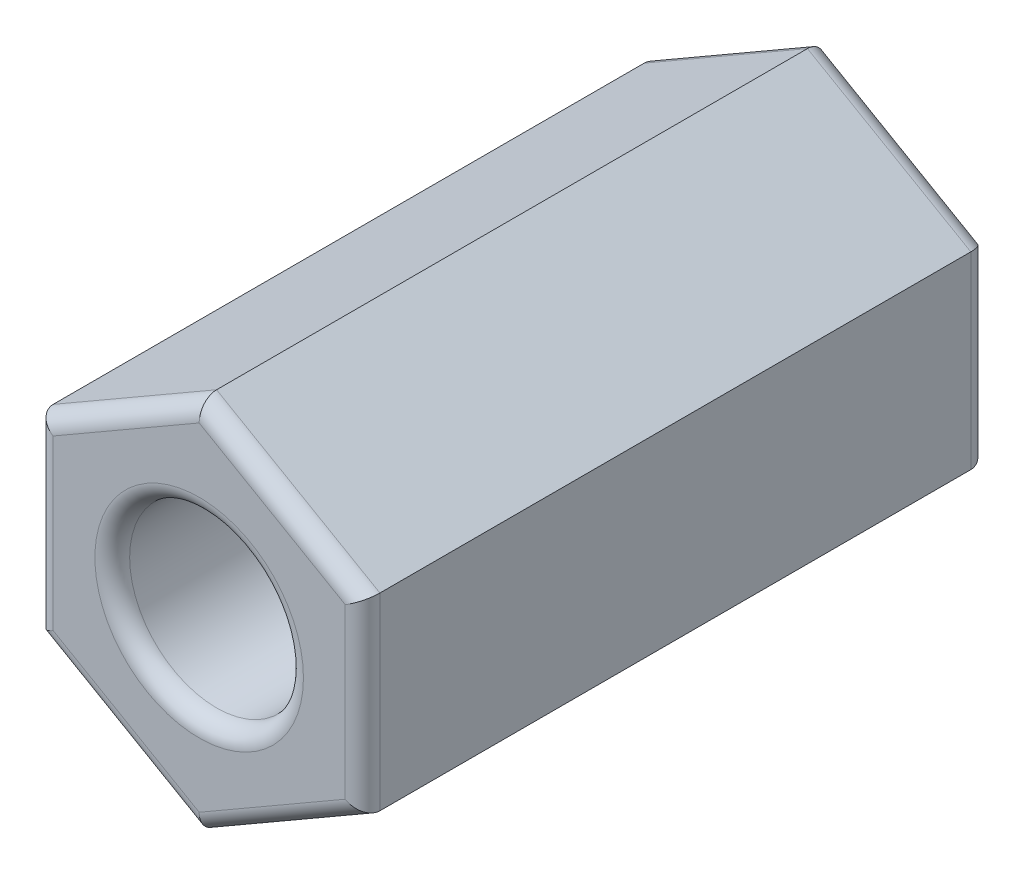
ISO-10303-21;
HEADER;
FILE_DESCRIPTION(('STEP AP214'),'2;1');
FILE_NAME('part.step','',(''),(''),'','','');
FILE_SCHEMA(('AUTOMOTIVE_DESIGN { 1 0 10303 214 1 1 1 1 }'));
ENDSEC;
DATA;
#1=APPLICATION_CONTEXT('core data for automotive mechanical design processes');
#2=APPLICATION_PROTOCOL_DEFINITION('international standard','automotive_design',2000,#1);
#3=PRODUCT_CONTEXT('',#1,'mechanical');
#4=PRODUCT('Part','Part','',(#3));
#5=PRODUCT_RELATED_PRODUCT_CATEGORY('part','',(#4));
#6=PRODUCT_DEFINITION_FORMATION('','',#4);
#7=PRODUCT_DEFINITION_CONTEXT('part definition',#1,'design');
#8=PRODUCT_DEFINITION('design','',#6,#7);
#9=PRODUCT_DEFINITION_SHAPE('','',#8);
#10=(LENGTH_UNIT() NAMED_UNIT(*) SI_UNIT(.MILLI.,.METRE.));
#11=(NAMED_UNIT(*) PLANE_ANGLE_UNIT() SI_UNIT($,.RADIAN.));
#12=(NAMED_UNIT(*) SI_UNIT($,.STERADIAN.) SOLID_ANGLE_UNIT());
#13=UNCERTAINTY_MEASURE_WITH_UNIT(LENGTH_MEASURE(1.E-05),#10,'distance_accuracy_value','');
#14=(GEOMETRIC_REPRESENTATION_CONTEXT(3) GLOBAL_UNCERTAINTY_ASSIGNED_CONTEXT((#13)) GLOBAL_UNIT_ASSIGNED_CONTEXT((#10,
#11,#12)) REPRESENTATION_CONTEXT('',''));
#15=CARTESIAN_POINT('',(0.,0.,0.));
#16=DIRECTION('',(0.,0.,1.));
#17=DIRECTION('',(1.,0.,0.));
#18=AXIS2_PLACEMENT_3D('',#15,#16,#17);
#19=CARTESIAN_POINT('',(0.,0.,9.));
#20=DIRECTION('',(0.,0.,1.));
#21=DIRECTION('',(1.,0.,0.));
#22=AXIS2_PLACEMENT_3D('',#19,#20,#21);
#23=PLANE('',#22);
#24=CARTESIAN_POINT('',(0.,0.,9.));
#25=DIRECTION('',(0.,0.,1.));
#26=DIRECTION('',(1.,0.,0.));
#27=AXIS2_PLACEMENT_3D('',#24,#25,#26);
#28=CIRCLE('',#27,1.5);
#29=CARTESIAN_POINT('',(1.5,0.,9.));
#30=VERTEX_POINT('',#29);
#31=EDGE_CURVE('E11',#30,#30,#28,.F.);
#32=ORIENTED_EDGE('',*,*,#31,.T.);
#33=EDGE_LOOP('',(#32));
#34=FACE_BOUND('',#33,.T.);
#35=DIRECTION('',(-0.866025403784439,-0.5,0.));
#36=VECTOR('',#35,1.);
#37=CARTESIAN_POINT('',(-2.225,1.14026678164951,9.));
#38=LINE('',#37,#36);
#39=CARTESIAN_POINT('',(0.,2.42487113059643,9.));
#40=VERTEX_POINT('',#39);
#41=CARTESIAN_POINT('',(-2.1,1.21243556529821,9.));
#42=VERTEX_POINT('',#41);
#43=EDGE_CURVE('E262',#40,#42,#38,.T.);
#44=ORIENTED_EDGE('',*,*,#43,.T.);
#45=DIRECTION('',(0.,-1.,0.));
#46=VECTOR('',#45,1.);
#47=CARTESIAN_POINT('',(-2.1,-1.35677313259562,9.));
#48=LINE('',#47,#46);
#49=CARTESIAN_POINT('',(-2.1,-1.21243556529821,9.));
#50=VERTEX_POINT('',#49);
#51=EDGE_CURVE('E137',#42,#50,#48,.T.);
#52=ORIENTED_EDGE('',*,*,#51,.T.);
#53=DIRECTION('',(0.866025403784439,-0.5,0.));
#54=VECTOR('',#53,1.);
#55=CARTESIAN_POINT('',(0.124999999999999,-2.49703991424513,9.));
#56=LINE('',#55,#54);
#57=CARTESIAN_POINT('',(0.,-2.42487113059643,9.));
#58=VERTEX_POINT('',#57);
#59=EDGE_CURVE('E160',#50,#58,#56,.T.);
#60=ORIENTED_EDGE('',*,*,#59,.T.);
#61=DIRECTION('',(0.866025403784439,0.5,0.));
#62=VECTOR('',#61,1.);
#63=CARTESIAN_POINT('',(2.225,-1.14026678164951,9.));
#64=LINE('',#63,#62);
#65=CARTESIAN_POINT('',(2.1,-1.21243556529821,9.));
#66=VERTEX_POINT('',#65);
#67=EDGE_CURVE('E266',#58,#66,#64,.T.);
#68=ORIENTED_EDGE('',*,*,#67,.T.);
#69=DIRECTION('',(0.,1.,0.));
#70=VECTOR('',#69,1.);
#71=CARTESIAN_POINT('',(2.1,1.35677313259562,9.));
#72=LINE('',#71,#70);
#73=CARTESIAN_POINT('',(2.1,1.21243556529821,9.));
#74=VERTEX_POINT('',#73);
#75=EDGE_CURVE('E264',#66,#74,#72,.T.);
#76=ORIENTED_EDGE('',*,*,#75,.T.);
#77=DIRECTION('',(-0.866025403784439,0.5,0.));
#78=VECTOR('',#77,1.);
#79=CARTESIAN_POINT('',(-0.125000000000001,2.49703991424513,9.));
#80=LINE('',#79,#78);
#81=EDGE_CURVE('E220',#74,#40,#80,.T.);
#82=ORIENTED_EDGE('',*,*,#81,.T.);
#83=EDGE_LOOP('',(#44,#52,#60,#68,#76,#82));
#84=FACE_BOUND('',#83,.T.);
#85=ADVANCED_FACE('F34',(#34,#84),#23,.T.);
#86=CARTESIAN_POINT('',(0.,0.,0.));
#87=DIRECTION('',(0.,0.,1.));
#88=DIRECTION('',(1.,0.,0.));
#89=AXIS2_PLACEMENT_3D('',#86,#87,#88);
#90=PLANE('',#89);
#91=CARTESIAN_POINT('',(0.,0.,0.));
#92=DIRECTION('',(0.,0.,1.));
#93=DIRECTION('',(1.,0.,0.));
#94=AXIS2_PLACEMENT_3D('',#91,#92,#93);
#95=CIRCLE('',#94,1.5);
#96=CARTESIAN_POINT('',(1.5,0.,0.));
#97=VERTEX_POINT('',#96);
#98=EDGE_CURVE('E180',#97,#97,#95,.T.);
#99=ORIENTED_EDGE('',*,*,#98,.T.);
#100=EDGE_LOOP('',(#99));
#101=FACE_BOUND('',#100,.T.);
#102=DIRECTION('',(0.866025403784439,-0.5,0.));
#103=VECTOR('',#102,1.);
#104=CARTESIAN_POINT('',(-1.05,-1.81865334794732,0.));
#105=LINE('',#104,#103);
#106=CARTESIAN_POINT('',(0.,-2.42487113059643,0.));
#107=VERTEX_POINT('',#106);
#108=CARTESIAN_POINT('',(-2.1,-1.21243556529821,0.));
#109=VERTEX_POINT('',#108);
#110=EDGE_CURVE('E204',#107,#109,#105,.F.);
#111=ORIENTED_EDGE('',*,*,#110,.T.);
#112=DIRECTION('',(0.,-1.,0.));
#113=VECTOR('',#112,1.);
#114=CARTESIAN_POINT('',(-2.1,0.,0.));
#115=LINE('',#114,#113);
#116=CARTESIAN_POINT('',(-2.1,1.21243556529821,0.));
#117=VERTEX_POINT('',#116);
#118=EDGE_CURVE('E206',#109,#117,#115,.F.);
#119=ORIENTED_EDGE('',*,*,#118,.T.);
#120=DIRECTION('',(-0.866025403784439,-0.5,0.));
#121=VECTOR('',#120,1.);
#122=CARTESIAN_POINT('',(-1.05,1.81865334794732,0.));
#123=LINE('',#122,#121);
#124=CARTESIAN_POINT('',(0.,2.42487113059643,0.));
#125=VERTEX_POINT('',#124);
#126=EDGE_CURVE('E256',#117,#125,#123,.F.);
#127=ORIENTED_EDGE('',*,*,#126,.T.);
#128=DIRECTION('',(-0.866025403784439,0.5,0.));
#129=VECTOR('',#128,1.);
#130=CARTESIAN_POINT('',(1.05,1.81865334794732,0.));
#131=LINE('',#130,#129);
#132=CARTESIAN_POINT('',(2.1,1.21243556529821,0.));
#133=VERTEX_POINT('',#132);
#134=EDGE_CURVE('E254',#125,#133,#131,.F.);
#135=ORIENTED_EDGE('',*,*,#134,.T.);
#136=DIRECTION('',(0.,1.,0.));
#137=VECTOR('',#136,1.);
#138=CARTESIAN_POINT('',(2.1,0.,0.));
#139=LINE('',#138,#137);
#140=CARTESIAN_POINT('',(2.1,-1.21243556529821,0.));
#141=VERTEX_POINT('',#140);
#142=EDGE_CURVE('E258',#133,#141,#139,.F.);
#143=ORIENTED_EDGE('',*,*,#142,.T.);
#144=DIRECTION('',(0.866025403784439,0.5,0.));
#145=VECTOR('',#144,1.);
#146=CARTESIAN_POINT('',(1.05,-1.81865334794732,0.));
#147=LINE('',#146,#145);
#148=EDGE_CURVE('E208',#141,#107,#147,.F.);
#149=ORIENTED_EDGE('',*,*,#148,.T.);
#150=EDGE_LOOP('',(#111,#119,#127,#135,#143,#149));
#151=FACE_BOUND('',#150,.T.);
#152=ADVANCED_FACE('F197',(#101,#151),#90,.F.);
#153=CARTESIAN_POINT('',(2.35,-1.35677313259562,9.));
#154=DIRECTION('',(-1.,0.,0.));
#155=DIRECTION('',(0.,-1.,0.));
#156=AXIS2_PLACEMENT_3D('',#153,#154,#155);
#157=PLANE('',#156);
#158=DIRECTION('',(0.,0.,-1.));
#159=VECTOR('',#158,1.);
#160=CARTESIAN_POINT('',(2.35,1.35677313259562,9.));
#161=LINE('',#160,#159);
#162=CARTESIAN_POINT('',(2.35,1.35677313259562,8.75));
#163=VERTEX_POINT('',#162);
#164=CARTESIAN_POINT('',(2.35,1.35677313259562,0.25));
#165=VERTEX_POINT('',#164);
#166=EDGE_CURVE('E157',#163,#165,#161,.T.);
#167=ORIENTED_EDGE('',*,*,#166,.F.);
#168=DIRECTION('',(0.,1.,0.));
#169=VECTOR('',#168,1.);
#170=CARTESIAN_POINT('',(2.35,-1.35677313259562,8.75));
#171=LINE('',#170,#169);
#172=CARTESIAN_POINT('',(2.35,-1.35677313259562,8.75));
#173=VERTEX_POINT('',#172);
#174=EDGE_CURVE('E277',#163,#173,#171,.F.);
#175=ORIENTED_EDGE('',*,*,#174,.T.);
#176=DIRECTION('',(0.,0.,-1.));
#177=VECTOR('',#176,1.);
#178=CARTESIAN_POINT('',(2.35,-1.35677313259562,9.));
#179=LINE('',#178,#177);
#180=CARTESIAN_POINT('',(2.35,-1.35677313259562,0.25));
#181=VERTEX_POINT('',#180);
#182=EDGE_CURVE('E238',#173,#181,#179,.T.);
#183=ORIENTED_EDGE('',*,*,#182,.T.);
#184=DIRECTION('',(0.,1.,0.));
#185=VECTOR('',#184,1.);
#186=CARTESIAN_POINT('',(2.35,-1.35677313259562,0.25));
#187=LINE('',#186,#185);
#188=EDGE_CURVE('E275',#181,#165,#187,.T.);
#189=ORIENTED_EDGE('',*,*,#188,.T.);
#190=EDGE_LOOP('',(#167,#175,#183,#189));
#191=FACE_BOUND('',#190,.T.);
#192=ADVANCED_FACE('F200',(#191),#157,.F.);
#193=CARTESIAN_POINT('',(2.35,1.35677313259562,9.));
#194=DIRECTION('',(-0.5,-0.866025403784439,0.));
#195=DIRECTION('',(0.866025403784439,-0.5,0.));
#196=AXIS2_PLACEMENT_3D('',#193,#194,#195);
#197=PLANE('',#196);
#198=DIRECTION('',(0.,0.,-1.));
#199=VECTOR('',#198,1.);
#200=CARTESIAN_POINT('',(0.,2.71354626519124,9.));
#201=LINE('',#200,#199);
#202=CARTESIAN_POINT('',(0.,2.71354626519124,8.75));
#203=VERTEX_POINT('',#202);
#204=CARTESIAN_POINT('',(0.,2.71354626519124,0.25));
#205=VERTEX_POINT('',#204);
#206=EDGE_CURVE('E250',#203,#205,#201,.T.);
#207=ORIENTED_EDGE('',*,*,#206,.F.);
#208=DIRECTION('',(-0.866025403784439,0.5,0.));
#209=VECTOR('',#208,1.);
#210=CARTESIAN_POINT('',(2.35,1.35677313259562,8.75));
#211=LINE('',#210,#209);
#212=EDGE_CURVE('E184',#203,#163,#211,.F.);
#213=ORIENTED_EDGE('',*,*,#212,.T.);
#214=ORIENTED_EDGE('',*,*,#166,.T.);
#215=DIRECTION('',(-0.866025403784439,0.5,0.));
#216=VECTOR('',#215,1.);
#217=CARTESIAN_POINT('',(2.35,1.35677313259562,0.25));
#218=LINE('',#217,#216);
#219=EDGE_CURVE('E49',#165,#205,#218,.T.);
#220=ORIENTED_EDGE('',*,*,#219,.T.);
#221=EDGE_LOOP('',(#207,#213,#214,#220));
#222=FACE_BOUND('',#221,.T.);
#223=ADVANCED_FACE('F283',(#222),#197,.F.);
#224=CARTESIAN_POINT('',(0.,2.71354626519124,9.));
#225=DIRECTION('',(0.5,-0.866025403784439,0.));
#226=DIRECTION('',(0.866025403784439,0.5,0.));
#227=AXIS2_PLACEMENT_3D('',#224,#225,#226);
#228=PLANE('',#227);
#229=ORIENTED_EDGE('',*,*,#206,.T.);
#230=DIRECTION('',(-0.866025403784439,-0.5,0.));
#231=VECTOR('',#230,1.);
#232=CARTESIAN_POINT('',(0.,2.71354626519124,0.25));
#233=LINE('',#232,#231);
#234=CARTESIAN_POINT('',(-2.35,1.35677313259562,0.25));
#235=VERTEX_POINT('',#234);
#236=EDGE_CURVE('E280',#205,#235,#233,.T.);
#237=ORIENTED_EDGE('',*,*,#236,.T.);
#238=DIRECTION('',(0.,0.,-1.));
#239=VECTOR('',#238,1.);
#240=CARTESIAN_POINT('',(-2.35,1.35677313259562,9.));
#241=LINE('',#240,#239);
#242=CARTESIAN_POINT('',(-2.35,1.35677313259562,8.75));
#243=VERTEX_POINT('',#242);
#244=EDGE_CURVE('E148',#243,#235,#241,.T.);
#245=ORIENTED_EDGE('',*,*,#244,.F.);
#246=DIRECTION('',(-0.866025403784439,-0.5,0.));
#247=VECTOR('',#246,1.);
#248=CARTESIAN_POINT('',(0.,2.71354626519124,8.75));
#249=LINE('',#248,#247);
#250=EDGE_CURVE('E56',#243,#203,#249,.F.);
#251=ORIENTED_EDGE('',*,*,#250,.T.);
#252=EDGE_LOOP('',(#229,#237,#245,#251));
#253=FACE_BOUND('',#252,.T.);
#254=ADVANCED_FACE('F328',(#253),#228,.F.);
#255=CARTESIAN_POINT('',(-2.35,1.35677313259562,9.));
#256=DIRECTION('',(1.,0.,0.));
#257=DIRECTION('',(0.,1.,0.));
#258=AXIS2_PLACEMENT_3D('',#255,#256,#257);
#259=PLANE('',#258);
#260=ORIENTED_EDGE('',*,*,#244,.T.);
#261=DIRECTION('',(0.,-1.,0.));
#262=VECTOR('',#261,1.);
#263=CARTESIAN_POINT('',(-2.35,1.35677313259562,0.25));
#264=LINE('',#263,#262);
#265=CARTESIAN_POINT('',(-2.35,-1.35677313259562,0.25));
#266=VERTEX_POINT('',#265);
#267=EDGE_CURVE('E147',#235,#266,#264,.T.);
#268=ORIENTED_EDGE('',*,*,#267,.T.);
#269=DIRECTION('',(0.,0.,-1.));
#270=VECTOR('',#269,1.);
#271=CARTESIAN_POINT('',(-2.35,-1.35677313259562,9.));
#272=LINE('',#271,#270);
#273=CARTESIAN_POINT('',(-2.35,-1.35677313259562,8.75));
#274=VERTEX_POINT('',#273);
#275=EDGE_CURVE('E129',#274,#266,#272,.T.);
#276=ORIENTED_EDGE('',*,*,#275,.F.);
#277=DIRECTION('',(0.,-1.,0.));
#278=VECTOR('',#277,1.);
#279=CARTESIAN_POINT('',(-2.35,1.35677313259562,8.75));
#280=LINE('',#279,#278);
#281=EDGE_CURVE('E145',#274,#243,#280,.F.);
#282=ORIENTED_EDGE('',*,*,#281,.T.);
#283=EDGE_LOOP('',(#260,#268,#276,#282));
#284=FACE_BOUND('',#283,.T.);
#285=ADVANCED_FACE('F144',(#284),#259,.F.);
#286=CARTESIAN_POINT('',(-2.35,-1.35677313259562,9.));
#287=DIRECTION('',(0.5,0.866025403784439,0.));
#288=DIRECTION('',(-0.866025403784439,0.5,0.));
#289=AXIS2_PLACEMENT_3D('',#286,#287,#288);
#290=PLANE('',#289);
#291=ORIENTED_EDGE('',*,*,#275,.T.);
#292=DIRECTION('',(0.866025403784439,-0.5,0.));
#293=VECTOR('',#292,1.);
#294=CARTESIAN_POINT('',(-2.35,-1.35677313259562,0.25));
#295=LINE('',#294,#293);
#296=CARTESIAN_POINT('',(0.,-2.71354626519124,0.25));
#297=VERTEX_POINT('',#296);
#298=EDGE_CURVE('E136',#266,#297,#295,.T.);
#299=ORIENTED_EDGE('',*,*,#298,.T.);
#300=DIRECTION('',(0.,0.,-1.));
#301=VECTOR('',#300,1.);
#302=CARTESIAN_POINT('',(0.,-2.71354626519124,9.));
#303=LINE('',#302,#301);
#304=CARTESIAN_POINT('',(0.,-2.71354626519124,8.75));
#305=VERTEX_POINT('',#304);
#306=EDGE_CURVE('E131',#305,#297,#303,.T.);
#307=ORIENTED_EDGE('',*,*,#306,.F.);
#308=DIRECTION('',(0.866025403784439,-0.5,0.));
#309=VECTOR('',#308,1.);
#310=CARTESIAN_POINT('',(-2.35,-1.35677313259562,8.75));
#311=LINE('',#310,#309);
#312=EDGE_CURVE('E126',#305,#274,#311,.F.);
#313=ORIENTED_EDGE('',*,*,#312,.T.);
#314=EDGE_LOOP('',(#291,#299,#307,#313));
#315=FACE_BOUND('',#314,.T.);
#316=ADVANCED_FACE('F128',(#315),#290,.F.);
#317=CARTESIAN_POINT('',(0.,-2.71354626519124,9.));
#318=DIRECTION('',(-0.5,0.866025403784439,0.));
#319=DIRECTION('',(-0.866025403784439,-0.5,0.));
#320=AXIS2_PLACEMENT_3D('',#317,#318,#319);
#321=PLANE('',#320);
#322=ORIENTED_EDGE('',*,*,#306,.T.);
#323=DIRECTION('',(0.866025403784439,0.5,0.));
#324=VECTOR('',#323,1.);
#325=CARTESIAN_POINT('',(0.,-2.71354626519124,0.25));
#326=LINE('',#325,#324);
#327=EDGE_CURVE('E273',#297,#181,#326,.T.);
#328=ORIENTED_EDGE('',*,*,#327,.T.);
#329=ORIENTED_EDGE('',*,*,#182,.F.);
#330=DIRECTION('',(0.866025403784439,0.5,0.));
#331=VECTOR('',#330,1.);
#332=CARTESIAN_POINT('',(0.,-2.71354626519124,8.75));
#333=LINE('',#332,#331);
#334=EDGE_CURVE('E271',#173,#305,#333,.F.);
#335=ORIENTED_EDGE('',*,*,#334,.T.);
#336=EDGE_LOOP('',(#322,#328,#329,#335));
#337=FACE_BOUND('',#336,.T.);
#338=ADVANCED_FACE('F301',(#337),#321,.F.);
#339=CARTESIAN_POINT('',(0.,0.,9.));
#340=DIRECTION('',(0.,0.,-1.));
#341=DIRECTION('',(-1.,0.,0.));
#342=AXIS2_PLACEMENT_3D('',#339,#340,#341);
#343=CYLINDRICAL_SURFACE('',#342,1.25);
#344=CARTESIAN_POINT('',(0.,0.,0.25));
#345=DIRECTION('',(0.,0.,1.));
#346=DIRECTION('',(1.,0.,0.));
#347=AXIS2_PLACEMENT_3D('',#344,#345,#346);
#348=CIRCLE('',#347,1.25);
#349=CARTESIAN_POINT('',(1.25,0.,0.25));
#350=VERTEX_POINT('',#349);
#351=EDGE_CURVE('E42',#350,#350,#348,.F.);
#352=ORIENTED_EDGE('',*,*,#351,.T.);
#353=EDGE_LOOP('',(#352));
#354=FACE_BOUND('',#353,.T.);
#355=CARTESIAN_POINT('',(0.,0.,8.75));
#356=DIRECTION('',(0.,0.,1.));
#357=DIRECTION('',(1.,0.,0.));
#358=AXIS2_PLACEMENT_3D('',#355,#356,#357);
#359=CIRCLE('',#358,1.25);
#360=CARTESIAN_POINT('',(1.25,0.,8.75));
#361=VERTEX_POINT('',#360);
#362=EDGE_CURVE('E183',#361,#361,#359,.T.);
#363=ORIENTED_EDGE('',*,*,#362,.T.);
#364=EDGE_LOOP('',(#363));
#365=FACE_BOUND('',#364,.T.);
#366=ADVANCED_FACE('F189',(#354,#365),#343,.F.);
#367=CARTESIAN_POINT('',(2.1,-1.35677313259562,0.25));
#368=DIRECTION('',(0.,1.,0.));
#369=DIRECTION('',(-1.,0.,0.));
#370=AXIS2_PLACEMENT_3D('',#367,#368,#369);
#371=CYLINDRICAL_SURFACE('',#370,0.25);
#372=CARTESIAN_POINT('',(2.1,-1.21243556529821,0.25));
#373=DIRECTION('',(0.5,0.866025403784439,0.));
#374=DIRECTION('',(-0.866025403784439,0.5,0.));
#375=AXIS2_PLACEMENT_3D('',#372,#373,#374);
#376=ELLIPSE('',#375,0.288675134594813,0.25);
#377=EDGE_CURVE('E232',#141,#181,#376,.F.);
#378=ORIENTED_EDGE('',*,*,#377,.F.);
#379=ORIENTED_EDGE('',*,*,#142,.F.);
#380=CARTESIAN_POINT('',(2.1,1.21243556529821,0.25));
#381=DIRECTION('',(-0.5,0.866025403784439,0.));
#382=DIRECTION('',(-0.866025403784439,-0.5,0.));
#383=AXIS2_PLACEMENT_3D('',#380,#381,#382);
#384=ELLIPSE('',#383,0.288675134594813,0.25);
#385=EDGE_CURVE('E166',#165,#133,#384,.T.);
#386=ORIENTED_EDGE('',*,*,#385,.F.);
#387=ORIENTED_EDGE('',*,*,#188,.F.);
#388=EDGE_LOOP('',(#378,#379,#386,#387));
#389=FACE_BOUND('',#388,.T.);
#390=ADVANCED_FACE('F313',(#389),#371,.T.);
#391=CARTESIAN_POINT('',(2.225,1.14026678164951,0.25));
#392=DIRECTION('',(-0.866025403784439,0.5,0.));
#393=DIRECTION('',(-0.5,-0.866025403784439,0.));
#394=AXIS2_PLACEMENT_3D('',#391,#392,#393);
#395=CYLINDRICAL_SURFACE('',#394,0.25);
#396=ORIENTED_EDGE('',*,*,#385,.T.);
#397=ORIENTED_EDGE('',*,*,#134,.F.);
#398=CARTESIAN_POINT('',(0.,2.42487113059643,0.25));
#399=DIRECTION('',(-1.,0.,0.));
#400=DIRECTION('',(0.,1.,0.));
#401=AXIS2_PLACEMENT_3D('',#398,#399,#400);
#402=ELLIPSE('',#401,0.288675134594813,0.25);
#403=EDGE_CURVE('E230',#205,#125,#402,.T.);
#404=ORIENTED_EDGE('',*,*,#403,.F.);
#405=ORIENTED_EDGE('',*,*,#219,.F.);
#406=EDGE_LOOP('',(#396,#397,#404,#405));
#407=FACE_BOUND('',#406,.T.);
#408=ADVANCED_FACE('F305',(#407),#395,.T.);
#409=CARTESIAN_POINT('',(-0.125000000000001,-2.49703991424513,0.25));
#410=DIRECTION('',(0.866025403784439,0.5,0.));
#411=DIRECTION('',(-0.5,0.866025403784439,0.));
#412=AXIS2_PLACEMENT_3D('',#409,#410,#411);
#413=CYLINDRICAL_SURFACE('',#412,0.25);
#414=ORIENTED_EDGE('',*,*,#377,.T.);
#415=ORIENTED_EDGE('',*,*,#327,.F.);
#416=CARTESIAN_POINT('',(0.,-2.42487113059643,0.25));
#417=DIRECTION('',(1.,0.,0.));
#418=DIRECTION('',(0.,1.,0.));
#419=AXIS2_PLACEMENT_3D('',#416,#417,#418);
#420=ELLIPSE('',#419,0.288675134594813,0.25);
#421=EDGE_CURVE('E224',#107,#297,#420,.F.);
#422=ORIENTED_EDGE('',*,*,#421,.F.);
#423=ORIENTED_EDGE('',*,*,#148,.F.);
#424=EDGE_LOOP('',(#414,#415,#422,#423));
#425=FACE_BOUND('',#424,.T.);
#426=ADVANCED_FACE('F302',(#425),#413,.T.);
#427=CARTESIAN_POINT('',(0.125,2.49703991424513,0.25));
#428=DIRECTION('',(-0.866025403784439,-0.5,0.));
#429=DIRECTION('',(0.5,-0.866025403784439,0.));
#430=AXIS2_PLACEMENT_3D('',#427,#428,#429);
#431=CYLINDRICAL_SURFACE('',#430,0.25);
#432=ORIENTED_EDGE('',*,*,#403,.T.);
#433=ORIENTED_EDGE('',*,*,#126,.F.);
#434=CARTESIAN_POINT('',(-2.1,1.21243556529821,0.25));
#435=DIRECTION('',(-0.5,-0.866025403784439,0.));
#436=DIRECTION('',(-0.866025403784439,0.5,0.));
#437=AXIS2_PLACEMENT_3D('',#434,#435,#436);
#438=ELLIPSE('',#437,0.288675134594813,0.25);
#439=EDGE_CURVE('E218',#235,#117,#438,.T.);
#440=ORIENTED_EDGE('',*,*,#439,.F.);
#441=ORIENTED_EDGE('',*,*,#236,.F.);
#442=EDGE_LOOP('',(#432,#433,#440,#441));
#443=FACE_BOUND('',#442,.T.);
#444=ADVANCED_FACE('F304',(#443),#431,.T.);
#445=CARTESIAN_POINT('',(-2.225,-1.14026678164951,0.25));
#446=DIRECTION('',(0.866025403784439,-0.5,0.));
#447=DIRECTION('',(0.5,0.866025403784439,0.));
#448=AXIS2_PLACEMENT_3D('',#445,#446,#447);
#449=CYLINDRICAL_SURFACE('',#448,0.25);
#450=ORIENTED_EDGE('',*,*,#421,.T.);
#451=ORIENTED_EDGE('',*,*,#298,.F.);
#452=CARTESIAN_POINT('',(-2.1,-1.21243556529821,0.25));
#453=DIRECTION('',(0.5,-0.866025403784439,0.));
#454=DIRECTION('',(0.866025403784439,0.5,0.));
#455=AXIS2_PLACEMENT_3D('',#452,#453,#454);
#456=ELLIPSE('',#455,0.288675134594813,0.25);
#457=EDGE_CURVE('E179',#109,#266,#456,.F.);
#458=ORIENTED_EDGE('',*,*,#457,.F.);
#459=ORIENTED_EDGE('',*,*,#110,.F.);
#460=EDGE_LOOP('',(#450,#451,#458,#459));
#461=FACE_BOUND('',#460,.T.);
#462=ADVANCED_FACE('F222',(#461),#449,.T.);
#463=CARTESIAN_POINT('',(-2.1,1.35677313259562,0.25));
#464=DIRECTION('',(0.,-1.,0.));
#465=DIRECTION('',(1.,0.,0.));
#466=AXIS2_PLACEMENT_3D('',#463,#464,#465);
#467=CYLINDRICAL_SURFACE('',#466,0.25);
#468=ORIENTED_EDGE('',*,*,#439,.T.);
#469=ORIENTED_EDGE('',*,*,#118,.F.);
#470=ORIENTED_EDGE('',*,*,#457,.T.);
#471=ORIENTED_EDGE('',*,*,#267,.F.);
#472=EDGE_LOOP('',(#468,#469,#470,#471));
#473=FACE_BOUND('',#472,.T.);
#474=ADVANCED_FACE('F215',(#473),#467,.T.);
#475=CARTESIAN_POINT('',(2.1,0.,8.75));
#476=DIRECTION('',(0.,-1.,0.));
#477=DIRECTION('',(1.,0.,0.));
#478=AXIS2_PLACEMENT_3D('',#475,#476,#477);
#479=CYLINDRICAL_SURFACE('',#478,0.25);
#480=CARTESIAN_POINT('',(2.1,-1.21243556529821,8.75));
#481=DIRECTION('',(-0.5,-0.866025403784439,0.));
#482=DIRECTION('',(0.866025403784439,-0.5,0.));
#483=AXIS2_PLACEMENT_3D('',#480,#481,#482);
#484=ELLIPSE('',#483,0.288675134594813,0.25);
#485=EDGE_CURVE('E173',#173,#66,#484,.T.);
#486=ORIENTED_EDGE('',*,*,#485,.F.);
#487=ORIENTED_EDGE('',*,*,#174,.F.);
#488=CARTESIAN_POINT('',(2.1,1.21243556529821,8.75));
#489=DIRECTION('',(0.5,-0.866025403784439,0.));
#490=DIRECTION('',(0.866025403784439,0.5,0.));
#491=AXIS2_PLACEMENT_3D('',#488,#489,#490);
#492=ELLIPSE('',#491,0.288675134594813,0.25);
#493=EDGE_CURVE('E176',#74,#163,#492,.F.);
#494=ORIENTED_EDGE('',*,*,#493,.F.);
#495=ORIENTED_EDGE('',*,*,#75,.F.);
#496=EDGE_LOOP('',(#486,#487,#494,#495));
#497=FACE_BOUND('',#496,.T.);
#498=ADVANCED_FACE('F290',(#497),#479,.T.);
#499=CARTESIAN_POINT('',(1.05,1.81865334794732,8.75));
#500=DIRECTION('',(0.866025403784439,-0.5,0.));
#501=DIRECTION('',(0.5,0.866025403784439,0.));
#502=AXIS2_PLACEMENT_3D('',#499,#500,#501);
#503=CYLINDRICAL_SURFACE('',#502,0.25);
#504=ORIENTED_EDGE('',*,*,#493,.T.);
#505=ORIENTED_EDGE('',*,*,#212,.F.);
#506=CARTESIAN_POINT('',(0.,2.42487113059643,8.75));
#507=DIRECTION('',(1.,0.,0.));
#508=DIRECTION('',(0.,-1.,0.));
#509=AXIS2_PLACEMENT_3D('',#506,#507,#508);
#510=ELLIPSE('',#509,0.288675134594813,0.25);
#511=EDGE_CURVE('E170',#40,#203,#510,.F.);
#512=ORIENTED_EDGE('',*,*,#511,.F.);
#513=ORIENTED_EDGE('',*,*,#81,.F.);
#514=EDGE_LOOP('',(#504,#505,#512,#513));
#515=FACE_BOUND('',#514,.T.);
#516=ADVANCED_FACE('F294',(#515),#503,.T.);
#517=CARTESIAN_POINT('',(1.05,-1.81865334794732,8.75));
#518=DIRECTION('',(-0.866025403784439,-0.5,0.));
#519=DIRECTION('',(0.5,-0.866025403784439,0.));
#520=AXIS2_PLACEMENT_3D('',#517,#518,#519);
#521=CYLINDRICAL_SURFACE('',#520,0.25);
#522=ORIENTED_EDGE('',*,*,#485,.T.);
#523=ORIENTED_EDGE('',*,*,#67,.F.);
#524=CARTESIAN_POINT('',(0.,-2.42487113059643,8.75));
#525=DIRECTION('',(-1.,0.,0.));
#526=DIRECTION('',(0.,-1.,0.));
#527=AXIS2_PLACEMENT_3D('',#524,#525,#526);
#528=ELLIPSE('',#527,0.288675134594813,0.25);
#529=EDGE_CURVE('E163',#305,#58,#528,.T.);
#530=ORIENTED_EDGE('',*,*,#529,.F.);
#531=ORIENTED_EDGE('',*,*,#334,.F.);
#532=EDGE_LOOP('',(#522,#523,#530,#531));
#533=FACE_BOUND('',#532,.T.);
#534=ADVANCED_FACE('F299',(#533),#521,.T.);
#535=CARTESIAN_POINT('',(-1.05,1.81865334794732,8.75));
#536=DIRECTION('',(0.866025403784439,0.5,0.));
#537=DIRECTION('',(-0.5,0.866025403784439,0.));
#538=AXIS2_PLACEMENT_3D('',#535,#536,#537);
#539=CYLINDRICAL_SURFACE('',#538,0.25);
#540=ORIENTED_EDGE('',*,*,#511,.T.);
#541=ORIENTED_EDGE('',*,*,#250,.F.);
#542=CARTESIAN_POINT('',(-2.1,1.21243556529821,8.75));
#543=DIRECTION('',(0.5,0.866025403784439,0.));
#544=DIRECTION('',(0.866025403784439,-0.5,0.));
#545=AXIS2_PLACEMENT_3D('',#542,#543,#544);
#546=ELLIPSE('',#545,0.288675134594813,0.25);
#547=EDGE_CURVE('E156',#42,#243,#546,.F.);
#548=ORIENTED_EDGE('',*,*,#547,.F.);
#549=ORIENTED_EDGE('',*,*,#43,.F.);
#550=EDGE_LOOP('',(#540,#541,#548,#549));
#551=FACE_BOUND('',#550,.T.);
#552=ADVANCED_FACE('F364',(#551),#539,.T.);
#553=CARTESIAN_POINT('',(-1.05,-1.81865334794732,8.75));
#554=DIRECTION('',(-0.866025403784439,0.5,0.));
#555=DIRECTION('',(-0.5,-0.866025403784439,0.));
#556=AXIS2_PLACEMENT_3D('',#553,#554,#555);
#557=CYLINDRICAL_SURFACE('',#556,0.25);
#558=ORIENTED_EDGE('',*,*,#529,.T.);
#559=ORIENTED_EDGE('',*,*,#59,.F.);
#560=CARTESIAN_POINT('',(-2.1,-1.21243556529821,8.75));
#561=DIRECTION('',(-0.5,0.866025403784439,0.));
#562=DIRECTION('',(-0.866025403784439,-0.5,0.));
#563=AXIS2_PLACEMENT_3D('',#560,#561,#562);
#564=ELLIPSE('',#563,0.288675134594813,0.25);
#565=EDGE_CURVE('E153',#274,#50,#564,.T.);
#566=ORIENTED_EDGE('',*,*,#565,.F.);
#567=ORIENTED_EDGE('',*,*,#312,.F.);
#568=EDGE_LOOP('',(#558,#559,#566,#567));
#569=FACE_BOUND('',#568,.T.);
#570=ADVANCED_FACE('F159',(#569),#557,.T.);
#571=CARTESIAN_POINT('',(-2.1,0.,8.75));
#572=DIRECTION('',(0.,1.,0.));
#573=DIRECTION('',(-1.,0.,0.));
#574=AXIS2_PLACEMENT_3D('',#571,#572,#573);
#575=CYLINDRICAL_SURFACE('',#574,0.25);
#576=ORIENTED_EDGE('',*,*,#547,.T.);
#577=ORIENTED_EDGE('',*,*,#281,.F.);
#578=ORIENTED_EDGE('',*,*,#565,.T.);
#579=ORIENTED_EDGE('',*,*,#51,.F.);
#580=EDGE_LOOP('',(#576,#577,#578,#579));
#581=FACE_BOUND('',#580,.T.);
#582=ADVANCED_FACE('F151',(#581),#575,.T.);
#583=CARTESIAN_POINT('',(0.,0.,0.25));
#584=DIRECTION('',(0.,0.,1.));
#585=DIRECTION('',(1.,0.,0.));
#586=AXIS2_PLACEMENT_3D('',#583,#584,#585);
#587=TOROIDAL_SURFACE('',#586,1.5,0.25);
#588=ORIENTED_EDGE('',*,*,#351,.F.);
#589=EDGE_LOOP('',(#588));
#590=FACE_BOUND('',#589,.T.);
#591=ORIENTED_EDGE('',*,*,#98,.F.);
#592=EDGE_LOOP('',(#591));
#593=FACE_BOUND('',#592,.T.);
#594=ADVANCED_FACE('F192',(#590,#593),#587,.T.);
#595=CARTESIAN_POINT('',(0.,0.,8.75));
#596=DIRECTION('',(0.,0.,1.));
#597=DIRECTION('',(1.,0.,0.));
#598=AXIS2_PLACEMENT_3D('',#595,#596,#597);
#599=TOROIDAL_SURFACE('',#598,1.5,0.25);
#600=ORIENTED_EDGE('',*,*,#31,.F.);
#601=EDGE_LOOP('',(#600));
#602=FACE_BOUND('',#601,.T.);
#603=ORIENTED_EDGE('',*,*,#362,.F.);
#604=EDGE_LOOP('',(#603));
#605=FACE_BOUND('',#604,.T.);
#606=ADVANCED_FACE('F36',(#602,#605),#599,.T.);
#607=CLOSED_SHELL('',(#85,#152,#192,#223,#254,#285,#316,#338,#366,#390,#408,#426,#444,#462,#474,
#498,#516,#534,#552,#570,#582,#594,#606));
#608=MANIFOLD_SOLID_BREP('B2',#607);
#609=ADVANCED_BREP_SHAPE_REPRESENTATION('',(#18,#608),#14);
#610=SHAPE_DEFINITION_REPRESENTATION(#9,#609);
ENDSEC;
END-ISO-10303-21;
